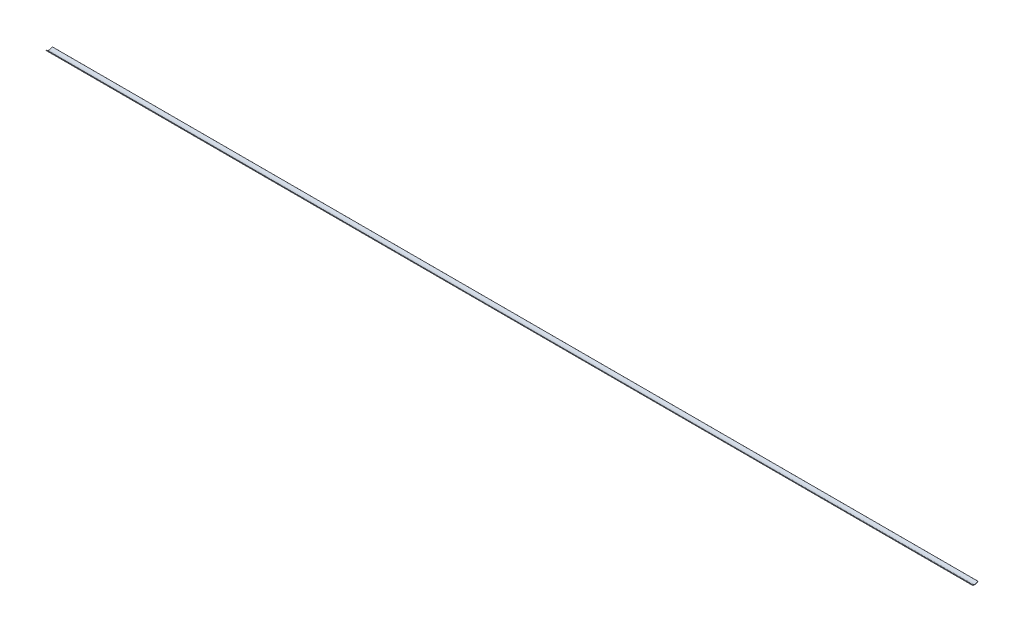
ISO-10303-21;
HEADER;
FILE_DESCRIPTION(('STEP AP214'),'2;1');
FILE_NAME('part.step','',(''),(''),'','','');
FILE_SCHEMA(('AUTOMOTIVE_DESIGN { 1 0 10303 214 1 1 1 1 }'));
ENDSEC;
DATA;
#1=APPLICATION_CONTEXT('core data for automotive mechanical design processes');
#2=APPLICATION_PROTOCOL_DEFINITION('international standard','automotive_design',2000,#1);
#3=PRODUCT_CONTEXT('',#1,'mechanical');
#4=PRODUCT('Part','Part','',(#3));
#5=PRODUCT_RELATED_PRODUCT_CATEGORY('part','',(#4));
#6=PRODUCT_DEFINITION_FORMATION('','',#4);
#7=PRODUCT_DEFINITION_CONTEXT('part definition',#1,'design');
#8=PRODUCT_DEFINITION('design','',#6,#7);
#9=PRODUCT_DEFINITION_SHAPE('','',#8);
#10=(LENGTH_UNIT() NAMED_UNIT(*) SI_UNIT(.MILLI.,.METRE.));
#11=(NAMED_UNIT(*) PLANE_ANGLE_UNIT() SI_UNIT($,.RADIAN.));
#12=(NAMED_UNIT(*) SI_UNIT($,.STERADIAN.) SOLID_ANGLE_UNIT());
#13=UNCERTAINTY_MEASURE_WITH_UNIT(LENGTH_MEASURE(1.E-05),#10,'distance_accuracy_value','');
#14=(GEOMETRIC_REPRESENTATION_CONTEXT(3) GLOBAL_UNCERTAINTY_ASSIGNED_CONTEXT((#13)) GLOBAL_UNIT_ASSIGNED_CONTEXT((#10,
#11,#12)) REPRESENTATION_CONTEXT('',''));
#15=CARTESIAN_POINT('',(0.,0.,0.));
#16=DIRECTION('',(0.,0.,1.));
#17=DIRECTION('',(1.,0.,0.));
#18=AXIS2_PLACEMENT_3D('',#15,#16,#17);
#19=CARTESIAN_POINT('',(800.,29.4231207696028,0.));
#20=DIRECTION('',(-1.,0.,0.));
#21=DIRECTION('',(0.,0.,1.));
#22=AXIS2_PLACEMENT_3D('',#19,#20,#21);
#23=CYLINDRICAL_SURFACE('',#22,3.68531906277748);
#24=CARTESIAN_POINT('',(0.,29.4231207696028,0.));
#25=DIRECTION('',(1.,0.,0.));
#26=DIRECTION('',(0.,0.,-1.));
#27=AXIS2_PLACEMENT_3D('',#24,#25,#26);
#28=CIRCLE('',#27,3.68531906277748);
#29=CARTESIAN_POINT('',(0.,27.0256687739739,2.79889273162191));
#30=VERTEX_POINT('',#29);
#31=CARTESIAN_POINT('',(0.,26.9452933335025,-2.72799336351454));
#32=VERTEX_POINT('',#31);
#33=EDGE_CURVE('E96',#30,#32,#28,.T.);
#34=ORIENTED_EDGE('',*,*,#33,.T.);
#35=DIRECTION('',(-1.,0.,0.));
#36=VECTOR('',#35,1.);
#37=CARTESIAN_POINT('',(800.,26.9452933335025,-2.72799336351454));
#38=LINE('',#37,#36);
#39=CARTESIAN_POINT('',(800.,26.9452933335025,-2.72799336351454));
#40=VERTEX_POINT('',#39);
#41=EDGE_CURVE('E11',#40,#32,#38,.T.);
#42=ORIENTED_EDGE('',*,*,#41,.F.);
#43=CARTESIAN_POINT('',(800.,29.4231207696028,0.));
#44=DIRECTION('',(1.,0.,0.));
#45=DIRECTION('',(0.,0.,-1.));
#46=AXIS2_PLACEMENT_3D('',#43,#44,#45);
#47=CIRCLE('',#46,3.68531906277748);
#48=CARTESIAN_POINT('',(800.,27.0256687739739,2.79889273162191));
#49=VERTEX_POINT('',#48);
#50=EDGE_CURVE('E84',#49,#40,#47,.T.);
#51=ORIENTED_EDGE('',*,*,#50,.F.);
#52=DIRECTION('',(-1.,0.,0.));
#53=VECTOR('',#52,1.);
#54=CARTESIAN_POINT('',(800.,27.0256687739739,2.79889273162191));
#55=LINE('',#54,#53);
#56=EDGE_CURVE('E92',#49,#30,#55,.T.);
#57=ORIENTED_EDGE('',*,*,#56,.T.);
#58=EDGE_LOOP('',(#34,#42,#51,#57));
#59=FACE_BOUND('',#58,.T.);
#60=ADVANCED_FACE('F33',(#59),#23,.T.);
#61=CARTESIAN_POINT('',(800.,26.9452933335025,-2.72799336351454));
#62=DIRECTION('',(0.,-0.74023261406804,0.672350858607317));
#63=DIRECTION('',(0.,-0.672350858607317,-0.74023261406804));
#64=AXIS2_PLACEMENT_3D('',#61,#62,#63);
#65=PLANE('',#64);
#66=DIRECTION('',(0.,0.672350858607316,0.74023261406804));
#67=VECTOR('',#66,1.);
#68=CARTESIAN_POINT('',(0.,26.9452933335025,-2.72799336351454));
#69=LINE('',#68,#67);
#70=CARTESIAN_POINT('',(0.,27.1549256830174,-2.49719615386114));
#71=VERTEX_POINT('',#70);
#72=EDGE_CURVE('E88',#32,#71,#69,.T.);
#73=ORIENTED_EDGE('',*,*,#72,.T.);
#74=DIRECTION('',(-1.,0.,0.));
#75=VECTOR('',#74,1.);
#76=CARTESIAN_POINT('',(800.,27.1549256830174,-2.49719615386114));
#77=LINE('',#76,#75);
#78=CARTESIAN_POINT('',(800.,27.1549256830174,-2.49719615386114));
#79=VERTEX_POINT('',#78);
#80=EDGE_CURVE('E41',#79,#71,#77,.T.);
#81=ORIENTED_EDGE('',*,*,#80,.F.);
#82=DIRECTION('',(0.,0.672350858607316,0.74023261406804));
#83=VECTOR('',#82,1.);
#84=CARTESIAN_POINT('',(800.,26.9452933335025,-2.72799336351454));
#85=LINE('',#84,#83);
#86=EDGE_CURVE('E79',#40,#79,#85,.T.);
#87=ORIENTED_EDGE('',*,*,#86,.F.);
#88=ORIENTED_EDGE('',*,*,#41,.T.);
#89=EDGE_LOOP('',(#73,#81,#87,#88));
#90=FACE_BOUND('',#89,.T.);
#91=ADVANCED_FACE('F87',(#90),#65,.F.);
#92=CARTESIAN_POINT('',(800.,29.4231207696028,0.));
#93=DIRECTION('',(-1.,0.,0.));
#94=DIRECTION('',(0.,0.,1.));
#95=AXIS2_PLACEMENT_3D('',#92,#93,#94);
#96=CYLINDRICAL_SURFACE('',#95,3.37352895076791);
#97=CARTESIAN_POINT('',(0.,29.4231207696028,0.));
#98=DIRECTION('',(-1.,0.,0.));
#99=DIRECTION('',(0.,0.,1.));
#100=AXIS2_PLACEMENT_3D('',#97,#98,#99);
#101=CIRCLE('',#100,3.37352895076791);
#102=CARTESIAN_POINT('',(0.,27.2235370826491,2.55783681765596));
#103=VERTEX_POINT('',#102);
#104=EDGE_CURVE('E66',#71,#103,#101,.T.);
#105=ORIENTED_EDGE('',*,*,#104,.T.);
#106=DIRECTION('',(-1.,0.,0.));
#107=VECTOR('',#106,1.);
#108=CARTESIAN_POINT('',(800.,27.2235370826491,2.55783681765596));
#109=LINE('',#108,#107);
#110=CARTESIAN_POINT('',(800.,27.2235370826491,2.55783681765596));
#111=VERTEX_POINT('',#110);
#112=EDGE_CURVE('E89',#111,#103,#109,.T.);
#113=ORIENTED_EDGE('',*,*,#112,.F.);
#114=CARTESIAN_POINT('',(800.,29.4231207696028,0.));
#115=DIRECTION('',(-1.,0.,0.));
#116=DIRECTION('',(0.,0.,1.));
#117=AXIS2_PLACEMENT_3D('',#114,#115,#116);
#118=CIRCLE('',#117,3.37352895076791);
#119=EDGE_CURVE('E82',#79,#111,#118,.T.);
#120=ORIENTED_EDGE('',*,*,#119,.F.);
#121=ORIENTED_EDGE('',*,*,#80,.T.);
#122=EDGE_LOOP('',(#105,#113,#120,#121));
#123=FACE_BOUND('',#122,.T.);
#124=ADVANCED_FACE('F90',(#123),#96,.F.);
#125=CARTESIAN_POINT('',(800.,27.2235370826491,2.55783681765596));
#126=DIRECTION('',(0.,-0.772949387283598,-0.634467686094343));
#127=DIRECTION('',(0.,0.634467686094343,-0.772949387283598));
#128=AXIS2_PLACEMENT_3D('',#125,#126,#127);
#129=PLANE('',#128);
#130=DIRECTION('',(0.,-0.634467686094343,0.772949387283598));
#131=VECTOR('',#130,1.);
#132=CARTESIAN_POINT('',(0.,27.2235370826491,2.55783681765596));
#133=LINE('',#132,#131);
#134=EDGE_CURVE('E72',#103,#30,#133,.T.);
#135=ORIENTED_EDGE('',*,*,#134,.T.);
#136=ORIENTED_EDGE('',*,*,#56,.F.);
#137=DIRECTION('',(0.,-0.634467686094343,0.772949387283598));
#138=VECTOR('',#137,1.);
#139=CARTESIAN_POINT('',(800.,27.2235370826491,2.55783681765596));
#140=LINE('',#139,#138);
#141=EDGE_CURVE('E49',#111,#49,#140,.T.);
#142=ORIENTED_EDGE('',*,*,#141,.F.);
#143=ORIENTED_EDGE('',*,*,#112,.T.);
#144=EDGE_LOOP('',(#135,#136,#142,#143));
#145=FACE_BOUND('',#144,.T.);
#146=ADVANCED_FACE('F103',(#145),#129,.F.);
#147=CARTESIAN_POINT('',(800.,29.4231207696028,0.));
#148=DIRECTION('',(1.,0.,0.));
#149=DIRECTION('',(0.,0.,-1.));
#150=AXIS2_PLACEMENT_3D('',#147,#148,#149);
#151=PLANE('',#150);
#152=ORIENTED_EDGE('',*,*,#50,.T.);
#153=ORIENTED_EDGE('',*,*,#86,.T.);
#154=ORIENTED_EDGE('',*,*,#119,.T.);
#155=ORIENTED_EDGE('',*,*,#141,.T.);
#156=EDGE_LOOP('',(#152,#153,#154,#155));
#157=FACE_BOUND('',#156,.T.);
#158=ADVANCED_FACE('F80',(#157),#151,.T.);
#159=CARTESIAN_POINT('',(0.,29.4231207696028,0.));
#160=DIRECTION('',(1.,0.,0.));
#161=DIRECTION('',(0.,0.,-1.));
#162=AXIS2_PLACEMENT_3D('',#159,#160,#161);
#163=PLANE('',#162);
#164=ORIENTED_EDGE('',*,*,#33,.F.);
#165=ORIENTED_EDGE('',*,*,#134,.F.);
#166=ORIENTED_EDGE('',*,*,#104,.F.);
#167=ORIENTED_EDGE('',*,*,#72,.F.);
#168=EDGE_LOOP('',(#164,#165,#166,#167));
#169=FACE_BOUND('',#168,.T.);
#170=ADVANCED_FACE('F106',(#169),#163,.F.);
#171=CLOSED_SHELL('',(#60,#91,#124,#146,#158,#170));
#172=MANIFOLD_SOLID_BREP('B2',#171);
#173=ADVANCED_BREP_SHAPE_REPRESENTATION('',(#18,#172),#14);
#174=SHAPE_DEFINITION_REPRESENTATION(#9,#173);
ENDSEC;
END-ISO-10303-21;
